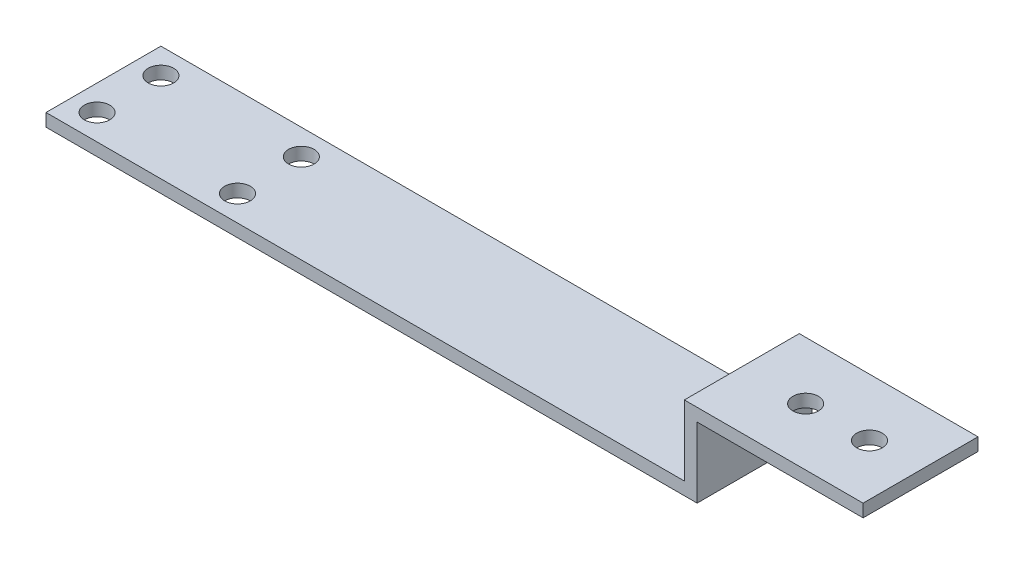
ISO-10303-21;
HEADER;
FILE_DESCRIPTION(('STEP AP214'),'2;1');
FILE_NAME('part.step','',(''),(''),'','','');
FILE_SCHEMA(('AUTOMOTIVE_DESIGN { 1 0 10303 214 1 1 1 1 }'));
ENDSEC;
DATA;
#1=APPLICATION_CONTEXT('core data for automotive mechanical design processes');
#2=APPLICATION_PROTOCOL_DEFINITION('international standard','automotive_design',2000,#1);
#3=PRODUCT_CONTEXT('',#1,'mechanical');
#4=PRODUCT('Part','Part','',(#3));
#5=PRODUCT_RELATED_PRODUCT_CATEGORY('part','',(#4));
#6=PRODUCT_DEFINITION_FORMATION('','',#4);
#7=PRODUCT_DEFINITION_CONTEXT('part definition',#1,'design');
#8=PRODUCT_DEFINITION('design','',#6,#7);
#9=PRODUCT_DEFINITION_SHAPE('','',#8);
#10=(LENGTH_UNIT() NAMED_UNIT(*) SI_UNIT(.MILLI.,.METRE.));
#11=(NAMED_UNIT(*) PLANE_ANGLE_UNIT() SI_UNIT($,.RADIAN.));
#12=(NAMED_UNIT(*) SI_UNIT($,.STERADIAN.) SOLID_ANGLE_UNIT());
#13=UNCERTAINTY_MEASURE_WITH_UNIT(LENGTH_MEASURE(1.E-05),#10,'distance_accuracy_value','');
#14=(GEOMETRIC_REPRESENTATION_CONTEXT(3) GLOBAL_UNCERTAINTY_ASSIGNED_CONTEXT((#13)) GLOBAL_UNIT_ASSIGNED_CONTEXT((#10,
#11,#12)) REPRESENTATION_CONTEXT('',''));
#15=CARTESIAN_POINT('',(0.,0.,0.));
#16=DIRECTION('',(0.,0.,1.));
#17=DIRECTION('',(1.,0.,0.));
#18=AXIS2_PLACEMENT_3D('',#15,#16,#17);
#19=CARTESIAN_POINT('',(0.,-2.00000000000001,18.));
#20=DIRECTION('',(1.,0.,0.));
#21=DIRECTION('',(0.,0.,-1.));
#22=AXIS2_PLACEMENT_3D('',#19,#20,#21);
#23=PLANE('',#22);
#24=DIRECTION('',(0.,-1.,0.));
#25=VECTOR('',#24,1.);
#26=CARTESIAN_POINT('',(0.,-2.00000000000001,0.));
#27=LINE('',#26,#25);
#28=CARTESIAN_POINT('',(0.,0.,0.));
#29=VERTEX_POINT('',#28);
#30=CARTESIAN_POINT('',(0.,-2.00000000000001,0.));
#31=VERTEX_POINT('',#30);
#32=EDGE_CURVE('E128',#29,#31,#27,.T.);
#33=ORIENTED_EDGE('',*,*,#32,.T.);
#34=DIRECTION('',(0.,0.,-1.));
#35=VECTOR('',#34,1.);
#36=CARTESIAN_POINT('',(0.,-2.00000000000001,18.));
#37=LINE('',#36,#35);
#38=CARTESIAN_POINT('',(0.,-2.00000000000001,18.));
#39=VERTEX_POINT('',#38);
#40=EDGE_CURVE('E11',#39,#31,#37,.T.);
#41=ORIENTED_EDGE('',*,*,#40,.F.);
#42=DIRECTION('',(0.,-1.,0.));
#43=VECTOR('',#42,1.);
#44=CARTESIAN_POINT('',(0.,-2.00000000000001,18.));
#45=LINE('',#44,#43);
#46=CARTESIAN_POINT('',(0.,0.,18.));
#47=VERTEX_POINT('',#46);
#48=EDGE_CURVE('E143',#47,#39,#45,.T.);
#49=ORIENTED_EDGE('',*,*,#48,.F.);
#50=DIRECTION('',(0.,0.,-1.));
#51=VECTOR('',#50,1.);
#52=CARTESIAN_POINT('',(0.,0.,18.));
#53=LINE('',#52,#51);
#54=EDGE_CURVE('E124',#47,#29,#53,.T.);
#55=ORIENTED_EDGE('',*,*,#54,.T.);
#56=EDGE_LOOP('',(#33,#41,#49,#55));
#57=FACE_BOUND('',#56,.T.);
#58=ADVANCED_FACE('F32',(#57),#23,.F.);
#59=CARTESIAN_POINT('',(102.,-2.,18.));
#60=DIRECTION('',(0.,1.,0.));
#61=DIRECTION('',(-1.,0.,0.));
#62=AXIS2_PLACEMENT_3D('',#59,#60,#61);
#63=PLANE('',#62);
#64=CARTESIAN_POINT('',(4.,-2.00000000000001,4.));
#65=DIRECTION('',(0.,1.,0.));
#66=DIRECTION('',(-1.,0.,0.));
#67=AXIS2_PLACEMENT_3D('',#64,#65,#66);
#68=CIRCLE('',#67,2.);
#69=CARTESIAN_POINT('',(2.,-2.00000000000001,4.));
#70=VERTEX_POINT('',#69);
#71=EDGE_CURVE('E181',#70,#70,#68,.F.);
#72=ORIENTED_EDGE('',*,*,#71,.F.);
#73=EDGE_LOOP('',(#72));
#74=FACE_BOUND('',#73,.T.);
#75=CARTESIAN_POINT('',(26.,-2.00000000000001,14.));
#76=DIRECTION('',(0.,1.,0.));
#77=DIRECTION('',(-1.,0.,0.));
#78=AXIS2_PLACEMENT_3D('',#75,#76,#77);
#79=CIRCLE('',#78,2.);
#80=CARTESIAN_POINT('',(24.,-2.00000000000001,14.));
#81=VERTEX_POINT('',#80);
#82=EDGE_CURVE('E182',#81,#81,#79,.F.);
#83=ORIENTED_EDGE('',*,*,#82,.F.);
#84=EDGE_LOOP('',(#83));
#85=FACE_BOUND('',#84,.T.);
#86=CARTESIAN_POINT('',(26.,-2.00000000000001,4.));
#87=DIRECTION('',(0.,1.,0.));
#88=DIRECTION('',(-1.,0.,0.));
#89=AXIS2_PLACEMENT_3D('',#86,#87,#88);
#90=CIRCLE('',#89,2.);
#91=CARTESIAN_POINT('',(24.,-2.00000000000001,4.));
#92=VERTEX_POINT('',#91);
#93=EDGE_CURVE('E189',#92,#92,#90,.F.);
#94=ORIENTED_EDGE('',*,*,#93,.F.);
#95=EDGE_LOOP('',(#94));
#96=FACE_BOUND('',#95,.T.);
#97=CARTESIAN_POINT('',(4.,-2.00000000000001,14.));
#98=DIRECTION('',(0.,1.,0.));
#99=DIRECTION('',(-1.,0.,0.));
#100=AXIS2_PLACEMENT_3D('',#97,#98,#99);
#101=CIRCLE('',#100,2.);
#102=CARTESIAN_POINT('',(2.,-2.00000000000001,14.));
#103=VERTEX_POINT('',#102);
#104=EDGE_CURVE('E132',#103,#103,#101,.F.);
#105=ORIENTED_EDGE('',*,*,#104,.F.);
#106=EDGE_LOOP('',(#105));
#107=FACE_BOUND('',#106,.T.);
#108=DIRECTION('',(1.,0.,0.));
#109=VECTOR('',#108,1.);
#110=CARTESIAN_POINT('',(102.,-2.,0.));
#111=LINE('',#110,#109);
#112=CARTESIAN_POINT('',(102.,-2.,0.));
#113=VERTEX_POINT('',#112);
#114=EDGE_CURVE('E131',#31,#113,#111,.T.);
#115=ORIENTED_EDGE('',*,*,#114,.T.);
#116=DIRECTION('',(0.,0.,-1.));
#117=VECTOR('',#116,1.);
#118=CARTESIAN_POINT('',(102.,-2.,18.));
#119=LINE('',#118,#117);
#120=CARTESIAN_POINT('',(102.,-2.,18.));
#121=VERTEX_POINT('',#120);
#122=EDGE_CURVE('E40',#121,#113,#119,.T.);
#123=ORIENTED_EDGE('',*,*,#122,.F.);
#124=DIRECTION('',(1.,0.,0.));
#125=VECTOR('',#124,1.);
#126=CARTESIAN_POINT('',(102.,-2.,18.));
#127=LINE('',#126,#125);
#128=EDGE_CURVE('E91',#39,#121,#127,.T.);
#129=ORIENTED_EDGE('',*,*,#128,.F.);
#130=ORIENTED_EDGE('',*,*,#40,.T.);
#131=EDGE_LOOP('',(#115,#123,#129,#130));
#132=FACE_BOUND('',#131,.T.);
#133=ADVANCED_FACE('F239',(#74,#85,#96,#107,#132),#63,.F.);
#134=CARTESIAN_POINT('',(102.,9.,18.));
#135=DIRECTION('',(-1.,0.,0.));
#136=DIRECTION('',(0.,0.,1.));
#137=AXIS2_PLACEMENT_3D('',#134,#135,#136);
#138=PLANE('',#137);
#139=DIRECTION('',(0.,1.,0.));
#140=VECTOR('',#139,1.);
#141=CARTESIAN_POINT('',(102.,9.,0.));
#142=LINE('',#141,#140);
#143=CARTESIAN_POINT('',(102.,9.,0.));
#144=VERTEX_POINT('',#143);
#145=EDGE_CURVE('E134',#113,#144,#142,.T.);
#146=ORIENTED_EDGE('',*,*,#145,.T.);
#147=DIRECTION('',(0.,0.,-1.));
#148=VECTOR('',#147,1.);
#149=CARTESIAN_POINT('',(102.,9.,18.));
#150=LINE('',#149,#148);
#151=CARTESIAN_POINT('',(102.,9.,18.));
#152=VERTEX_POINT('',#151);
#153=EDGE_CURVE('E150',#152,#144,#150,.T.);
#154=ORIENTED_EDGE('',*,*,#153,.F.);
#155=DIRECTION('',(0.,1.,0.));
#156=VECTOR('',#155,1.);
#157=CARTESIAN_POINT('',(102.,9.,18.));
#158=LINE('',#157,#156);
#159=EDGE_CURVE('E158',#121,#152,#158,.T.);
#160=ORIENTED_EDGE('',*,*,#159,.F.);
#161=ORIENTED_EDGE('',*,*,#122,.T.);
#162=EDGE_LOOP('',(#146,#154,#160,#161));
#163=FACE_BOUND('',#162,.T.);
#164=ADVANCED_FACE('F156',(#163),#138,.F.);
#165=CARTESIAN_POINT('',(128.,9.,18.));
#166=DIRECTION('',(0.,1.,0.));
#167=DIRECTION('',(-1.,0.,0.));
#168=AXIS2_PLACEMENT_3D('',#165,#166,#167);
#169=PLANE('',#168);
#170=CARTESIAN_POINT('',(120.,9.,9.));
#171=DIRECTION('',(0.,-1.,0.));
#172=DIRECTION('',(1.,0.,0.));
#173=AXIS2_PLACEMENT_3D('',#170,#171,#172);
#174=CIRCLE('',#173,2.);
#175=CARTESIAN_POINT('',(122.,9.,9.));
#176=VERTEX_POINT('',#175);
#177=EDGE_CURVE('E203',#176,#176,#174,.T.);
#178=ORIENTED_EDGE('',*,*,#177,.F.);
#179=EDGE_LOOP('',(#178));
#180=FACE_BOUND('',#179,.T.);
#181=CARTESIAN_POINT('',(110.,9.,9.));
#182=DIRECTION('',(0.,-1.,0.));
#183=DIRECTION('',(1.,0.,0.));
#184=AXIS2_PLACEMENT_3D('',#181,#182,#183);
#185=CIRCLE('',#184,2.);
#186=CARTESIAN_POINT('',(112.,9.,9.));
#187=VERTEX_POINT('',#186);
#188=EDGE_CURVE('E204',#187,#187,#185,.T.);
#189=ORIENTED_EDGE('',*,*,#188,.F.);
#190=EDGE_LOOP('',(#189));
#191=FACE_BOUND('',#190,.T.);
#192=DIRECTION('',(1.,0.,0.));
#193=VECTOR('',#192,1.);
#194=CARTESIAN_POINT('',(128.,9.,0.));
#195=LINE('',#194,#193);
#196=CARTESIAN_POINT('',(128.,9.,0.));
#197=VERTEX_POINT('',#196);
#198=EDGE_CURVE('E136',#144,#197,#195,.T.);
#199=ORIENTED_EDGE('',*,*,#198,.T.);
#200=DIRECTION('',(0.,0.,-1.));
#201=VECTOR('',#200,1.);
#202=CARTESIAN_POINT('',(128.,9.,18.));
#203=LINE('',#202,#201);
#204=CARTESIAN_POINT('',(128.,9.,18.));
#205=VERTEX_POINT('',#204);
#206=EDGE_CURVE('E147',#205,#197,#203,.T.);
#207=ORIENTED_EDGE('',*,*,#206,.F.);
#208=DIRECTION('',(1.,0.,0.));
#209=VECTOR('',#208,1.);
#210=CARTESIAN_POINT('',(128.,9.,18.));
#211=LINE('',#210,#209);
#212=EDGE_CURVE('E170',#152,#205,#211,.T.);
#213=ORIENTED_EDGE('',*,*,#212,.F.);
#214=ORIENTED_EDGE('',*,*,#153,.T.);
#215=EDGE_LOOP('',(#199,#207,#213,#214));
#216=FACE_BOUND('',#215,.T.);
#217=ADVANCED_FACE('F166',(#180,#191,#216),#169,.F.);
#218=CARTESIAN_POINT('',(128.,11.,18.));
#219=DIRECTION('',(-1.,0.,0.));
#220=DIRECTION('',(0.,0.,1.));
#221=AXIS2_PLACEMENT_3D('',#218,#219,#220);
#222=PLANE('',#221);
#223=DIRECTION('',(0.,1.,0.));
#224=VECTOR('',#223,1.);
#225=CARTESIAN_POINT('',(128.,11.,0.));
#226=LINE('',#225,#224);
#227=CARTESIAN_POINT('',(128.,11.,0.));
#228=VERTEX_POINT('',#227);
#229=EDGE_CURVE('E138',#197,#228,#226,.T.);
#230=ORIENTED_EDGE('',*,*,#229,.T.);
#231=DIRECTION('',(0.,0.,-1.));
#232=VECTOR('',#231,1.);
#233=CARTESIAN_POINT('',(128.,11.,18.));
#234=LINE('',#233,#232);
#235=CARTESIAN_POINT('',(128.,11.,18.));
#236=VERTEX_POINT('',#235);
#237=EDGE_CURVE('E119',#236,#228,#234,.T.);
#238=ORIENTED_EDGE('',*,*,#237,.F.);
#239=DIRECTION('',(0.,1.,0.));
#240=VECTOR('',#239,1.);
#241=CARTESIAN_POINT('',(128.,11.,18.));
#242=LINE('',#241,#240);
#243=EDGE_CURVE('E110',#205,#236,#242,.T.);
#244=ORIENTED_EDGE('',*,*,#243,.F.);
#245=ORIENTED_EDGE('',*,*,#206,.T.);
#246=EDGE_LOOP('',(#230,#238,#244,#245));
#247=FACE_BOUND('',#246,.T.);
#248=ADVANCED_FACE('F169',(#247),#222,.F.);
#249=CARTESIAN_POINT('',(100.,11.,18.));
#250=DIRECTION('',(0.,-1.,0.));
#251=DIRECTION('',(0.,0.,-1.));
#252=AXIS2_PLACEMENT_3D('',#249,#250,#251);
#253=PLANE('',#252);
#254=CARTESIAN_POINT('',(120.,11.,9.));
#255=DIRECTION('',(0.,-1.,0.));
#256=DIRECTION('',(0.,0.,-1.));
#257=AXIS2_PLACEMENT_3D('',#254,#255,#256);
#258=CIRCLE('',#257,2.);
#259=CARTESIAN_POINT('',(120.,11.,7.));
#260=VERTEX_POINT('',#259);
#261=EDGE_CURVE('E199',#260,#260,#258,.F.);
#262=ORIENTED_EDGE('',*,*,#261,.F.);
#263=EDGE_LOOP('',(#262));
#264=FACE_BOUND('',#263,.T.);
#265=CARTESIAN_POINT('',(110.,11.,9.));
#266=DIRECTION('',(0.,-1.,0.));
#267=DIRECTION('',(0.,0.,-1.));
#268=AXIS2_PLACEMENT_3D('',#265,#266,#267);
#269=CIRCLE('',#268,2.);
#270=CARTESIAN_POINT('',(110.,11.,7.));
#271=VERTEX_POINT('',#270);
#272=EDGE_CURVE('E200',#271,#271,#269,.F.);
#273=ORIENTED_EDGE('',*,*,#272,.F.);
#274=EDGE_LOOP('',(#273));
#275=FACE_BOUND('',#274,.T.);
#276=DIRECTION('',(-1.,0.,0.));
#277=VECTOR('',#276,1.);
#278=CARTESIAN_POINT('',(100.,11.,0.));
#279=LINE('',#278,#277);
#280=CARTESIAN_POINT('',(100.,11.,0.));
#281=VERTEX_POINT('',#280);
#282=EDGE_CURVE('E118',#228,#281,#279,.T.);
#283=ORIENTED_EDGE('',*,*,#282,.T.);
#284=DIRECTION('',(0.,0.,-1.));
#285=VECTOR('',#284,1.);
#286=CARTESIAN_POINT('',(100.,11.,18.));
#287=LINE('',#286,#285);
#288=CARTESIAN_POINT('',(100.,11.,18.));
#289=VERTEX_POINT('',#288);
#290=EDGE_CURVE('E115',#289,#281,#287,.T.);
#291=ORIENTED_EDGE('',*,*,#290,.F.);
#292=DIRECTION('',(-1.,0.,0.));
#293=VECTOR('',#292,1.);
#294=CARTESIAN_POINT('',(100.,11.,18.));
#295=LINE('',#294,#293);
#296=EDGE_CURVE('E104',#236,#289,#295,.T.);
#297=ORIENTED_EDGE('',*,*,#296,.F.);
#298=ORIENTED_EDGE('',*,*,#237,.T.);
#299=EDGE_LOOP('',(#283,#291,#297,#298));
#300=FACE_BOUND('',#299,.T.);
#301=ADVANCED_FACE('F116',(#264,#275,#300),#253,.F.);
#302=CARTESIAN_POINT('',(100.,0.,18.));
#303=DIRECTION('',(1.,0.,0.));
#304=DIRECTION('',(0.,0.,-1.));
#305=AXIS2_PLACEMENT_3D('',#302,#303,#304);
#306=PLANE('',#305);
#307=DIRECTION('',(0.,-1.,0.));
#308=VECTOR('',#307,1.);
#309=CARTESIAN_POINT('',(100.,0.,0.));
#310=LINE('',#309,#308);
#311=CARTESIAN_POINT('',(100.,0.,0.));
#312=VERTEX_POINT('',#311);
#313=EDGE_CURVE('E77',#281,#312,#310,.T.);
#314=ORIENTED_EDGE('',*,*,#313,.T.);
#315=DIRECTION('',(0.,0.,-1.));
#316=VECTOR('',#315,1.);
#317=CARTESIAN_POINT('',(100.,0.,18.));
#318=LINE('',#317,#316);
#319=CARTESIAN_POINT('',(100.,0.,18.));
#320=VERTEX_POINT('',#319);
#321=EDGE_CURVE('E120',#320,#312,#318,.T.);
#322=ORIENTED_EDGE('',*,*,#321,.F.);
#323=DIRECTION('',(0.,-1.,0.));
#324=VECTOR('',#323,1.);
#325=CARTESIAN_POINT('',(100.,0.,18.));
#326=LINE('',#325,#324);
#327=EDGE_CURVE('E108',#289,#320,#326,.T.);
#328=ORIENTED_EDGE('',*,*,#327,.F.);
#329=ORIENTED_EDGE('',*,*,#290,.T.);
#330=EDGE_LOOP('',(#314,#322,#328,#329));
#331=FACE_BOUND('',#330,.T.);
#332=ADVANCED_FACE('F122',(#331),#306,.F.);
#333=CARTESIAN_POINT('',(0.,0.,18.));
#334=DIRECTION('',(0.,-1.,0.));
#335=DIRECTION('',(0.,0.,-1.));
#336=AXIS2_PLACEMENT_3D('',#333,#334,#335);
#337=PLANE('',#336);
#338=CARTESIAN_POINT('',(4.,0.,4.));
#339=DIRECTION('',(0.,1.,0.));
#340=DIRECTION('',(0.,0.,1.));
#341=AXIS2_PLACEMENT_3D('',#338,#339,#340);
#342=CIRCLE('',#341,2.);
#343=CARTESIAN_POINT('',(4.,0.,6.));
#344=VERTEX_POINT('',#343);
#345=EDGE_CURVE('E185',#344,#344,#342,.T.);
#346=ORIENTED_EDGE('',*,*,#345,.F.);
#347=EDGE_LOOP('',(#346));
#348=FACE_BOUND('',#347,.T.);
#349=CARTESIAN_POINT('',(26.,0.,14.));
#350=DIRECTION('',(0.,1.,0.));
#351=DIRECTION('',(0.,0.,1.));
#352=AXIS2_PLACEMENT_3D('',#349,#350,#351);
#353=CIRCLE('',#352,2.);
#354=CARTESIAN_POINT('',(26.,0.,16.));
#355=VERTEX_POINT('',#354);
#356=EDGE_CURVE('E186',#355,#355,#353,.T.);
#357=ORIENTED_EDGE('',*,*,#356,.F.);
#358=EDGE_LOOP('',(#357));
#359=FACE_BOUND('',#358,.T.);
#360=CARTESIAN_POINT('',(26.,0.,4.));
#361=DIRECTION('',(0.,1.,0.));
#362=DIRECTION('',(0.,0.,1.));
#363=AXIS2_PLACEMENT_3D('',#360,#361,#362);
#364=CIRCLE('',#363,2.);
#365=CARTESIAN_POINT('',(26.,0.,6.));
#366=VERTEX_POINT('',#365);
#367=EDGE_CURVE('E196',#366,#366,#364,.T.);
#368=ORIENTED_EDGE('',*,*,#367,.F.);
#369=EDGE_LOOP('',(#368));
#370=FACE_BOUND('',#369,.T.);
#371=CARTESIAN_POINT('',(4.,0.,14.));
#372=DIRECTION('',(0.,1.,0.));
#373=DIRECTION('',(0.,0.,1.));
#374=AXIS2_PLACEMENT_3D('',#371,#372,#373);
#375=CIRCLE('',#374,2.);
#376=CARTESIAN_POINT('',(4.,0.,16.));
#377=VERTEX_POINT('',#376);
#378=EDGE_CURVE('E178',#377,#377,#375,.T.);
#379=ORIENTED_EDGE('',*,*,#378,.F.);
#380=EDGE_LOOP('',(#379));
#381=FACE_BOUND('',#380,.T.);
#382=DIRECTION('',(-1.,0.,0.));
#383=VECTOR('',#382,1.);
#384=CARTESIAN_POINT('',(0.,0.,0.));
#385=LINE('',#384,#383);
#386=EDGE_CURVE('E83',#312,#29,#385,.T.);
#387=ORIENTED_EDGE('',*,*,#386,.T.);
#388=ORIENTED_EDGE('',*,*,#54,.F.);
#389=DIRECTION('',(-1.,0.,0.));
#390=VECTOR('',#389,1.);
#391=CARTESIAN_POINT('',(0.,0.,18.));
#392=LINE('',#391,#390);
#393=EDGE_CURVE('E48',#320,#47,#392,.T.);
#394=ORIENTED_EDGE('',*,*,#393,.F.);
#395=ORIENTED_EDGE('',*,*,#321,.T.);
#396=EDGE_LOOP('',(#387,#388,#394,#395));
#397=FACE_BOUND('',#396,.T.);
#398=ADVANCED_FACE('F234',(#348,#359,#370,#381,#397),#337,.F.);
#399=CARTESIAN_POINT('',(0.,0.,18.));
#400=DIRECTION('',(0.,0.,-1.));
#401=DIRECTION('',(-1.,0.,0.));
#402=AXIS2_PLACEMENT_3D('',#399,#400,#401);
#403=PLANE('',#402);
#404=ORIENTED_EDGE('',*,*,#48,.T.);
#405=ORIENTED_EDGE('',*,*,#128,.T.);
#406=ORIENTED_EDGE('',*,*,#159,.T.);
#407=ORIENTED_EDGE('',*,*,#212,.T.);
#408=ORIENTED_EDGE('',*,*,#243,.T.);
#409=ORIENTED_EDGE('',*,*,#296,.T.);
#410=ORIENTED_EDGE('',*,*,#327,.T.);
#411=ORIENTED_EDGE('',*,*,#393,.T.);
#412=EDGE_LOOP('',(#404,#405,#406,#407,#408,#409,#410,#411));
#413=FACE_BOUND('',#412,.T.);
#414=ADVANCED_FACE('F106',(#413),#403,.F.);
#415=CARTESIAN_POINT('',(0.,0.,0.));
#416=DIRECTION('',(0.,0.,-1.));
#417=DIRECTION('',(-1.,0.,0.));
#418=AXIS2_PLACEMENT_3D('',#415,#416,#417);
#419=PLANE('',#418);
#420=ORIENTED_EDGE('',*,*,#32,.F.);
#421=ORIENTED_EDGE('',*,*,#386,.F.);
#422=ORIENTED_EDGE('',*,*,#313,.F.);
#423=ORIENTED_EDGE('',*,*,#282,.F.);
#424=ORIENTED_EDGE('',*,*,#229,.F.);
#425=ORIENTED_EDGE('',*,*,#198,.F.);
#426=ORIENTED_EDGE('',*,*,#145,.F.);
#427=ORIENTED_EDGE('',*,*,#114,.F.);
#428=EDGE_LOOP('',(#420,#421,#422,#423,#424,#425,#426,#427));
#429=FACE_BOUND('',#428,.T.);
#430=ADVANCED_FACE('F162',(#429),#419,.T.);
#431=CARTESIAN_POINT('',(4.,-2.00100000000001,14.));
#432=DIRECTION('',(0.,1.,0.));
#433=DIRECTION('',(0.,0.,1.));
#434=AXIS2_PLACEMENT_3D('',#431,#432,#433);
#435=CYLINDRICAL_SURFACE('',#434,2.);
#436=ORIENTED_EDGE('',*,*,#378,.T.);
#437=EDGE_LOOP('',(#436));
#438=FACE_BOUND('',#437,.T.);
#439=ORIENTED_EDGE('',*,*,#104,.T.);
#440=EDGE_LOOP('',(#439));
#441=FACE_BOUND('',#440,.T.);
#442=ADVANCED_FACE('F258',(#438,#441),#435,.F.);
#443=CARTESIAN_POINT('',(26.,-2.00100000000001,4.));
#444=DIRECTION('',(0.,1.,0.));
#445=DIRECTION('',(0.,0.,1.));
#446=AXIS2_PLACEMENT_3D('',#443,#444,#445);
#447=CYLINDRICAL_SURFACE('',#446,2.);
#448=ORIENTED_EDGE('',*,*,#367,.T.);
#449=EDGE_LOOP('',(#448));
#450=FACE_BOUND('',#449,.T.);
#451=ORIENTED_EDGE('',*,*,#93,.T.);
#452=EDGE_LOOP('',(#451));
#453=FACE_BOUND('',#452,.T.);
#454=ADVANCED_FACE('F262',(#450,#453),#447,.F.);
#455=CARTESIAN_POINT('',(26.,-2.00100000000001,14.));
#456=DIRECTION('',(0.,1.,0.));
#457=DIRECTION('',(0.,0.,1.));
#458=AXIS2_PLACEMENT_3D('',#455,#456,#457);
#459=CYLINDRICAL_SURFACE('',#458,2.);
#460=ORIENTED_EDGE('',*,*,#356,.T.);
#461=EDGE_LOOP('',(#460));
#462=FACE_BOUND('',#461,.T.);
#463=ORIENTED_EDGE('',*,*,#82,.T.);
#464=EDGE_LOOP('',(#463));
#465=FACE_BOUND('',#464,.T.);
#466=ADVANCED_FACE('F264',(#462,#465),#459,.F.);
#467=CARTESIAN_POINT('',(4.,-2.00100000000001,4.));
#468=DIRECTION('',(0.,1.,0.));
#469=DIRECTION('',(0.,0.,1.));
#470=AXIS2_PLACEMENT_3D('',#467,#468,#469);
#471=CYLINDRICAL_SURFACE('',#470,2.);
#472=ORIENTED_EDGE('',*,*,#345,.T.);
#473=EDGE_LOOP('',(#472));
#474=FACE_BOUND('',#473,.T.);
#475=ORIENTED_EDGE('',*,*,#71,.T.);
#476=EDGE_LOOP('',(#475));
#477=FACE_BOUND('',#476,.T.);
#478=ADVANCED_FACE('F223',(#474,#477),#471,.F.);
#479=CARTESIAN_POINT('',(110.,11.001,9.));
#480=DIRECTION('',(0.,-1.,0.));
#481=DIRECTION('',(1.,0.,0.));
#482=AXIS2_PLACEMENT_3D('',#479,#480,#481);
#483=CYLINDRICAL_SURFACE('',#482,2.);
#484=ORIENTED_EDGE('',*,*,#188,.T.);
#485=EDGE_LOOP('',(#484));
#486=FACE_BOUND('',#485,.T.);
#487=ORIENTED_EDGE('',*,*,#272,.T.);
#488=EDGE_LOOP('',(#487));
#489=FACE_BOUND('',#488,.T.);
#490=ADVANCED_FACE('F220',(#486,#489),#483,.F.);
#491=CARTESIAN_POINT('',(120.,11.001,9.));
#492=DIRECTION('',(0.,-1.,0.));
#493=DIRECTION('',(1.,0.,0.));
#494=AXIS2_PLACEMENT_3D('',#491,#492,#493);
#495=CYLINDRICAL_SURFACE('',#494,2.);
#496=ORIENTED_EDGE('',*,*,#177,.T.);
#497=EDGE_LOOP('',(#496));
#498=FACE_BOUND('',#497,.T.);
#499=ORIENTED_EDGE('',*,*,#261,.T.);
#500=EDGE_LOOP('',(#499));
#501=FACE_BOUND('',#500,.T.);
#502=ADVANCED_FACE('F212',(#498,#501),#495,.F.);
#503=CLOSED_SHELL('',(#58,#133,#164,#217,#248,#301,#332,#398,#414,#430,#442,#454,#466,#478,#490,#502));
#504=MANIFOLD_SOLID_BREP('B2',#503);
#505=ADVANCED_BREP_SHAPE_REPRESENTATION('',(#18,#504),#14);
#506=SHAPE_DEFINITION_REPRESENTATION(#9,#505);
ENDSEC;
END-ISO-10303-21;
